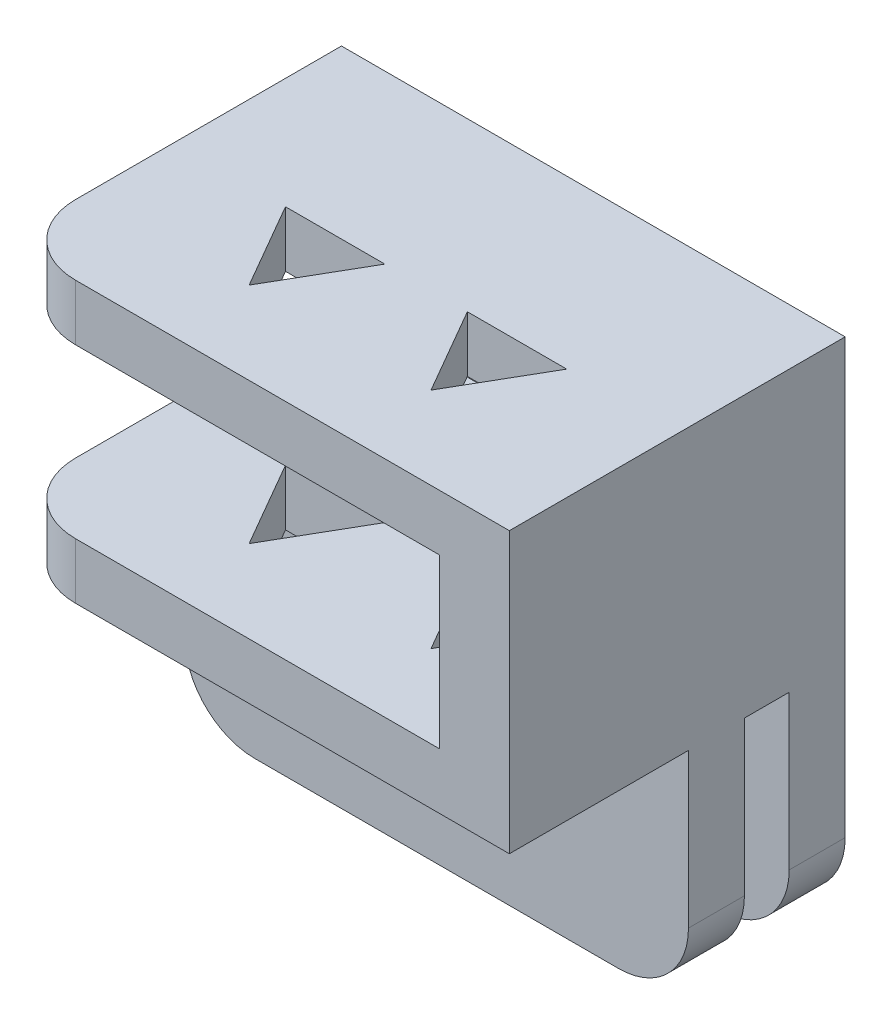
ISO-10303-21;
HEADER;
FILE_DESCRIPTION(('STEP AP214'),'2;1');
FILE_NAME('part.step','',(''),(''),'','','');
FILE_SCHEMA(('AUTOMOTIVE_DESIGN { 1 0 10303 214 1 1 1 1 }'));
ENDSEC;
DATA;
#1=APPLICATION_CONTEXT('core data for automotive mechanical design processes');
#2=APPLICATION_PROTOCOL_DEFINITION('international standard','automotive_design',2000,#1);
#3=PRODUCT_CONTEXT('',#1,'mechanical');
#4=PRODUCT('Part','Part','',(#3));
#5=PRODUCT_RELATED_PRODUCT_CATEGORY('part','',(#4));
#6=PRODUCT_DEFINITION_FORMATION('','',#4);
#7=PRODUCT_DEFINITION_CONTEXT('part definition',#1,'design');
#8=PRODUCT_DEFINITION('design','',#6,#7);
#9=PRODUCT_DEFINITION_SHAPE('','',#8);
#10=(LENGTH_UNIT() NAMED_UNIT(*) SI_UNIT(.MILLI.,.METRE.));
#11=(NAMED_UNIT(*) PLANE_ANGLE_UNIT() SI_UNIT($,.RADIAN.));
#12=(NAMED_UNIT(*) SI_UNIT($,.STERADIAN.) SOLID_ANGLE_UNIT());
#13=UNCERTAINTY_MEASURE_WITH_UNIT(LENGTH_MEASURE(1.E-05),#10,'distance_accuracy_value','');
#14=(GEOMETRIC_REPRESENTATION_CONTEXT(3) GLOBAL_UNCERTAINTY_ASSIGNED_CONTEXT((#13)) GLOBAL_UNIT_ASSIGNED_CONTEXT((#10,
#11,#12)) REPRESENTATION_CONTEXT('',''));
#15=CARTESIAN_POINT('',(0.,0.,0.));
#16=DIRECTION('',(0.,0.,1.));
#17=DIRECTION('',(1.,0.,0.));
#18=AXIS2_PLACEMENT_3D('',#15,#16,#17);
#19=CARTESIAN_POINT('',(-9.,0.,0.));
#20=DIRECTION('',(-1.,0.,0.));
#21=DIRECTION('',(0.,0.,1.));
#22=AXIS2_PLACEMENT_3D('',#19,#20,#21);
#23=PLANE('',#22);
#24=DIRECTION('',(0.,1.,0.));
#25=VECTOR('',#24,1.);
#26=CARTESIAN_POINT('',(-9.,-5.,-6.));
#27=LINE('',#26,#25);
#28=CARTESIAN_POINT('',(-9.,-10.5,-6.));
#29=VERTEX_POINT('',#28);
#30=CARTESIAN_POINT('',(-9.,-3.,-6.));
#31=VERTEX_POINT('',#30);
#32=EDGE_CURVE('E358',#29,#31,#27,.T.);
#33=ORIENTED_EDGE('',*,*,#32,.F.);
#34=DIRECTION('',(0.,0.,-1.));
#35=VECTOR('',#34,1.);
#36=CARTESIAN_POINT('',(-9.,-10.5,-4.));
#37=LINE('',#36,#35);
#38=CARTESIAN_POINT('',(-9.,-10.5,-4.));
#39=VERTEX_POINT('',#38);
#40=EDGE_CURVE('E470',#29,#39,#37,.F.);
#41=ORIENTED_EDGE('',*,*,#40,.T.);
#42=DIRECTION('',(0.,-1.,0.));
#43=VECTOR('',#42,1.);
#44=CARTESIAN_POINT('',(-9.,-13.,-4.));
#45=LINE('',#44,#43);
#46=CARTESIAN_POINT('',(-9.,-5.,-4.));
#47=VERTEX_POINT('',#46);
#48=EDGE_CURVE('E385',#47,#39,#45,.T.);
#49=ORIENTED_EDGE('',*,*,#48,.F.);
#50=DIRECTION('',(0.,0.,-1.));
#51=VECTOR('',#50,1.);
#52=CARTESIAN_POINT('',(-9.,-5.,-2.4));
#53=LINE('',#52,#51);
#54=CARTESIAN_POINT('',(-9.,-5.,-2.4));
#55=VERTEX_POINT('',#54);
#56=EDGE_CURVE('E383',#55,#47,#53,.T.);
#57=ORIENTED_EDGE('',*,*,#56,.F.);
#58=DIRECTION('',(0.,1.,0.));
#59=VECTOR('',#58,1.);
#60=CARTESIAN_POINT('',(-9.,-5.,-2.4));
#61=LINE('',#60,#59);
#62=CARTESIAN_POINT('',(-9.,-10.5,-2.4));
#63=VERTEX_POINT('',#62);
#64=EDGE_CURVE('E381',#63,#55,#61,.T.);
#65=ORIENTED_EDGE('',*,*,#64,.F.);
#66=DIRECTION('',(0.,0.,-1.));
#67=VECTOR('',#66,1.);
#68=CARTESIAN_POINT('',(-9.,-10.5,-0.400000000000004));
#69=LINE('',#68,#67);
#70=CARTESIAN_POINT('',(-9.,-10.5,-0.400000000000004));
#71=VERTEX_POINT('',#70);
#72=EDGE_CURVE('E468',#63,#71,#69,.F.);
#73=ORIENTED_EDGE('',*,*,#72,.T.);
#74=DIRECTION('',(0.,-1.,0.));
#75=VECTOR('',#74,1.);
#76=CARTESIAN_POINT('',(-9.,-13.,-0.400000000000004));
#77=LINE('',#76,#75);
#78=CARTESIAN_POINT('',(-9.,-5.,-0.400000000000004));
#79=VERTEX_POINT('',#78);
#80=EDGE_CURVE('E378',#79,#71,#77,.T.);
#81=ORIENTED_EDGE('',*,*,#80,.F.);
#82=DIRECTION('',(0.,0.,-1.));
#83=VECTOR('',#82,1.);
#84=CARTESIAN_POINT('',(-9.,-5.,6.));
#85=LINE('',#84,#83);
#86=CARTESIAN_POINT('',(-9.,-5.,3.5));
#87=VERTEX_POINT('',#86);
#88=EDGE_CURVE('E376',#87,#79,#85,.T.);
#89=ORIENTED_EDGE('',*,*,#88,.F.);
#90=DIRECTION('',(0.,-1.,0.));
#91=VECTOR('',#90,1.);
#92=CARTESIAN_POINT('',(-9.,-3.,3.5));
#93=LINE('',#92,#91);
#94=CARTESIAN_POINT('',(-9.,-3.,3.5));
#95=VERTEX_POINT('',#94);
#96=EDGE_CURVE('E466',#87,#95,#93,.F.);
#97=ORIENTED_EDGE('',*,*,#96,.T.);
#98=DIRECTION('',(0.,0.,1.));
#99=VECTOR('',#98,1.);
#100=CARTESIAN_POINT('',(-9.,-3.,-6.));
#101=LINE('',#100,#99);
#102=EDGE_CURVE('E349',#31,#95,#101,.T.);
#103=ORIENTED_EDGE('',*,*,#102,.F.);
#104=EDGE_LOOP('',(#33,#41,#49,#57,#65,#73,#81,#89,#97,#103));
#105=FACE_BOUND('',#104,.T.);
#106=ADVANCED_FACE('F33',(#105),#23,.T.);
#107=CARTESIAN_POINT('',(9.,5.,6.));
#108=DIRECTION('',(0.,-1.,0.));
#109=DIRECTION('',(0.,0.,-1.));
#110=AXIS2_PLACEMENT_3D('',#107,#108,#109);
#111=PLANE('',#110);
#112=DIRECTION('',(-1.,0.,0.));
#113=VECTOR('',#112,1.);
#114=CARTESIAN_POINT('',(-1.4746479222419,5.,-0.0250000000000033));
#115=LINE('',#114,#113);
#116=CARTESIAN_POINT('',(-1.4746479222419,5.,-0.0250000000000029));
#117=VERTEX_POINT('',#116);
#118=CARTESIAN_POINT('',(-5.0253520777581,5.,-0.0250000000000029));
#119=VERTEX_POINT('',#118);
#120=EDGE_CURVE('E258',#117,#119,#115,.T.);
#121=ORIENTED_EDGE('',*,*,#120,.F.);
#122=DIRECTION('',(0.5,0.,-0.866025403784439));
#123=VECTOR('',#122,1.);
#124=CARTESIAN_POINT('',(-3.25,5.,3.05));
#125=LINE('',#124,#123);
#126=CARTESIAN_POINT('',(-3.25,5.,3.05));
#127=VERTEX_POINT('',#126);
#128=EDGE_CURVE('E263',#127,#117,#125,.T.);
#129=ORIENTED_EDGE('',*,*,#128,.F.);
#130=DIRECTION('',(0.5,0.,0.866025403784439));
#131=VECTOR('',#130,1.);
#132=CARTESIAN_POINT('',(-5.0253520777581,5.,-0.0250000000000029));
#133=LINE('',#132,#131);
#134=EDGE_CURVE('E247',#119,#127,#133,.T.);
#135=ORIENTED_EDGE('',*,*,#134,.F.);
#136=EDGE_LOOP('',(#121,#129,#135));
#137=FACE_BOUND('',#136,.T.);
#138=DIRECTION('',(0.5,0.,-0.866025403784439));
#139=VECTOR('',#138,1.);
#140=CARTESIAN_POINT('',(3.25,5.,3.05));
#141=LINE('',#140,#139);
#142=CARTESIAN_POINT('',(3.25,5.,3.05));
#143=VERTEX_POINT('',#142);
#144=CARTESIAN_POINT('',(5.0253520777581,5.,-0.0250000000000007));
#145=VERTEX_POINT('',#144);
#146=EDGE_CURVE('E294',#143,#145,#141,.T.);
#147=ORIENTED_EDGE('',*,*,#146,.F.);
#148=DIRECTION('',(0.500000000000001,0.,0.866025403784438));
#149=VECTOR('',#148,1.);
#150=CARTESIAN_POINT('',(1.4746479222419,5.,-0.0249999999999998));
#151=LINE('',#150,#149);
#152=CARTESIAN_POINT('',(1.4746479222419,5.,-0.0249999999999998));
#153=VERTEX_POINT('',#152);
#154=EDGE_CURVE('E292',#153,#143,#151,.T.);
#155=ORIENTED_EDGE('',*,*,#154,.F.);
#156=DIRECTION('',(-1.,0.,0.));
#157=VECTOR('',#156,1.);
#158=CARTESIAN_POINT('',(5.0253520777581,5.,-0.0250000000000007));
#159=LINE('',#158,#157);
#160=EDGE_CURVE('E297',#145,#153,#159,.T.);
#161=ORIENTED_EDGE('',*,*,#160,.F.);
#162=EDGE_LOOP('',(#147,#155,#161));
#163=FACE_BOUND('',#162,.T.);
#164=DIRECTION('',(0.,0.,1.));
#165=VECTOR('',#164,1.);
#166=CARTESIAN_POINT('',(-9.,5.,6.));
#167=LINE('',#166,#165);
#168=CARTESIAN_POINT('',(-9.,5.,-6.));
#169=VERTEX_POINT('',#168);
#170=CARTESIAN_POINT('',(-9.,5.,3.5));
#171=VERTEX_POINT('',#170);
#172=EDGE_CURVE('E348',#169,#171,#167,.T.);
#173=ORIENTED_EDGE('',*,*,#172,.T.);
#174=CARTESIAN_POINT('',(-6.5,5.,3.5));
#175=DIRECTION('',(0.,-1.,0.));
#176=DIRECTION('',(0.,0.,-1.));
#177=AXIS2_PLACEMENT_3D('',#174,#175,#176);
#178=CIRCLE('',#177,2.5);
#179=CARTESIAN_POINT('',(-6.5,5.,6.));
#180=VERTEX_POINT('',#179);
#181=EDGE_CURVE('E480',#171,#180,#178,.F.);
#182=ORIENTED_EDGE('',*,*,#181,.T.);
#183=DIRECTION('',(-1.,0.,0.));
#184=VECTOR('',#183,1.);
#185=CARTESIAN_POINT('',(9.,5.,6.));
#186=LINE('',#185,#184);
#187=CARTESIAN_POINT('',(9.,5.,6.));
#188=VERTEX_POINT('',#187);
#189=EDGE_CURVE('E413',#188,#180,#186,.T.);
#190=ORIENTED_EDGE('',*,*,#189,.F.);
#191=DIRECTION('',(0.,0.,1.));
#192=VECTOR('',#191,1.);
#193=CARTESIAN_POINT('',(9.,5.,6.));
#194=LINE('',#193,#192);
#195=CARTESIAN_POINT('',(9.,5.,-6.));
#196=VERTEX_POINT('',#195);
#197=EDGE_CURVE('E357',#196,#188,#194,.T.);
#198=ORIENTED_EDGE('',*,*,#197,.F.);
#199=DIRECTION('',(-1.,0.,0.));
#200=VECTOR('',#199,1.);
#201=CARTESIAN_POINT('',(9.,5.,-6.));
#202=LINE('',#201,#200);
#203=EDGE_CURVE('E416',#196,#169,#202,.T.);
#204=ORIENTED_EDGE('',*,*,#203,.T.);
#205=EDGE_LOOP('',(#173,#182,#190,#198,#204));
#206=FACE_BOUND('',#205,.T.);
#207=ADVANCED_FACE('F265',(#137,#163,#206),#111,.F.);
#208=CARTESIAN_POINT('',(9.,5.,6.));
#209=DIRECTION('',(0.,0.,-1.));
#210=DIRECTION('',(0.,1.,0.));
#211=AXIS2_PLACEMENT_3D('',#208,#209,#210);
#212=PLANE('',#211);
#213=ORIENTED_EDGE('',*,*,#189,.T.);
#214=DIRECTION('',(0.,-1.,0.));
#215=VECTOR('',#214,1.);
#216=CARTESIAN_POINT('',(-6.5,3.,6.));
#217=LINE('',#216,#215);
#218=CARTESIAN_POINT('',(-6.5,3.,6.));
#219=VERTEX_POINT('',#218);
#220=EDGE_CURVE('E475',#180,#219,#217,.T.);
#221=ORIENTED_EDGE('',*,*,#220,.T.);
#222=DIRECTION('',(-1.,0.,0.));
#223=VECTOR('',#222,1.);
#224=CARTESIAN_POINT('',(-6.5,3.,6.));
#225=LINE('',#224,#223);
#226=CARTESIAN_POINT('',(6.5,3.,6.));
#227=VERTEX_POINT('',#226);
#228=EDGE_CURVE('E342',#227,#219,#225,.T.);
#229=ORIENTED_EDGE('',*,*,#228,.F.);
#230=DIRECTION('',(0.,1.,0.));
#231=VECTOR('',#230,1.);
#232=CARTESIAN_POINT('',(6.5,3.,6.));
#233=LINE('',#232,#231);
#234=CARTESIAN_POINT('',(6.5,-3.,6.));
#235=VERTEX_POINT('',#234);
#236=EDGE_CURVE('E328',#235,#227,#233,.T.);
#237=ORIENTED_EDGE('',*,*,#236,.F.);
#238=DIRECTION('',(1.,0.,0.));
#239=VECTOR('',#238,1.);
#240=CARTESIAN_POINT('',(-6.5,-3.,6.));
#241=LINE('',#240,#239);
#242=CARTESIAN_POINT('',(-6.5,-3.,6.));
#243=VERTEX_POINT('',#242);
#244=EDGE_CURVE('E333',#243,#235,#241,.T.);
#245=ORIENTED_EDGE('',*,*,#244,.F.);
#246=DIRECTION('',(0.,-1.,0.));
#247=VECTOR('',#246,1.);
#248=CARTESIAN_POINT('',(-6.5,-5.,6.));
#249=LINE('',#248,#247);
#250=CARTESIAN_POINT('',(-6.5,-5.,6.));
#251=VERTEX_POINT('',#250);
#252=EDGE_CURVE('E472',#243,#251,#249,.T.);
#253=ORIENTED_EDGE('',*,*,#252,.T.);
#254=DIRECTION('',(-1.,0.,0.));
#255=VECTOR('',#254,1.);
#256=CARTESIAN_POINT('',(9.,-5.,6.));
#257=LINE('',#256,#255);
#258=CARTESIAN_POINT('',(9.,-5.,6.));
#259=VERTEX_POINT('',#258);
#260=EDGE_CURVE('E410',#259,#251,#257,.T.);
#261=ORIENTED_EDGE('',*,*,#260,.F.);
#262=DIRECTION('',(0.,-1.,0.));
#263=VECTOR('',#262,1.);
#264=CARTESIAN_POINT('',(9.,5.,6.));
#265=LINE('',#264,#263);
#266=EDGE_CURVE('E360',#188,#259,#265,.T.);
#267=ORIENTED_EDGE('',*,*,#266,.F.);
#268=EDGE_LOOP('',(#213,#221,#229,#237,#245,#253,#261,#267));
#269=FACE_BOUND('',#268,.T.);
#270=ADVANCED_FACE('F501',(#269),#212,.F.);
#271=CARTESIAN_POINT('',(9.,-5.,6.));
#272=DIRECTION('',(0.,1.,0.));
#273=DIRECTION('',(0.,0.,1.));
#274=AXIS2_PLACEMENT_3D('',#271,#272,#273);
#275=PLANE('',#274);
#276=DIRECTION('',(0.5,0.,0.866025403784439));
#277=VECTOR('',#276,1.);
#278=CARTESIAN_POINT('',(1.08988747058204,-5.,10.5669055981797));
#279=LINE('',#278,#277);
#280=CARTESIAN_POINT('',(-5.0253520777581,-5.,-0.0250000000000025));
#281=VERTEX_POINT('',#280);
#282=CARTESIAN_POINT('',(-3.25,-5.,3.05));
#283=VERTEX_POINT('',#282);
#284=EDGE_CURVE('E283',#281,#283,#279,.T.);
#285=ORIENTED_EDGE('',*,*,#284,.T.);
#286=DIRECTION('',(0.5,0.,-0.866025403784439));
#287=VECTOR('',#286,1.);
#288=CARTESIAN_POINT('',(-1.46488747058205,-5.,-0.0419055981796847));
#289=LINE('',#288,#287);
#290=CARTESIAN_POINT('',(-1.4746479222419,-5.,-0.0250000000000033));
#291=VERTEX_POINT('',#290);
#292=EDGE_CURVE('E289',#283,#291,#289,.T.);
#293=ORIENTED_EDGE('',*,*,#292,.T.);
#294=DIRECTION('',(-1.,0.,0.));
#295=VECTOR('',#294,1.);
#296=CARTESIAN_POINT('',(9.,-5.,-0.0250000000000042));
#297=LINE('',#296,#295);
#298=EDGE_CURVE('E277',#291,#281,#297,.T.);
#299=ORIENTED_EDGE('',*,*,#298,.T.);
#300=EDGE_LOOP('',(#285,#293,#299));
#301=FACE_BOUND('',#300,.T.);
#302=DIRECTION('',(-1.,0.,0.));
#303=VECTOR('',#302,1.);
#304=CARTESIAN_POINT('',(9.,-5.,-0.0250000000000016));
#305=LINE('',#304,#303);
#306=CARTESIAN_POINT('',(5.0253520777581,-5.,-0.0250000000000007));
#307=VERTEX_POINT('',#306);
#308=CARTESIAN_POINT('',(1.4746479222419,-5.,-0.0249999999999998));
#309=VERTEX_POINT('',#308);
#310=EDGE_CURVE('E319',#307,#309,#305,.T.);
#311=ORIENTED_EDGE('',*,*,#310,.T.);
#312=DIRECTION('',(0.500000000000001,0.,0.866025403784438));
#313=VECTOR('',#312,1.);
#314=CARTESIAN_POINT('',(5.96488747058205,-5.,7.75232303588026));
#315=LINE('',#314,#313);
#316=CARTESIAN_POINT('',(3.25,-5.,3.05));
#317=VERTEX_POINT('',#316);
#318=EDGE_CURVE('E325',#309,#317,#315,.T.);
#319=ORIENTED_EDGE('',*,*,#318,.T.);
#320=DIRECTION('',(0.5,0.,-0.866025403784439));
#321=VECTOR('',#320,1.);
#322=CARTESIAN_POINT('',(3.41011252941795,-5.,2.77267696411974));
#323=LINE('',#322,#321);
#324=EDGE_CURVE('E313',#317,#307,#323,.T.);
#325=ORIENTED_EDGE('',*,*,#324,.T.);
#326=EDGE_LOOP('',(#311,#319,#325));
#327=FACE_BOUND('',#326,.T.);
#328=ORIENTED_EDGE('',*,*,#260,.T.);
#329=CARTESIAN_POINT('',(-6.5,-5.,3.5));
#330=DIRECTION('',(0.,1.,0.));
#331=DIRECTION('',(0.,0.,1.));
#332=AXIS2_PLACEMENT_3D('',#329,#330,#331);
#333=CIRCLE('',#332,2.5);
#334=EDGE_CURVE('E41',#251,#87,#333,.F.);
#335=ORIENTED_EDGE('',*,*,#334,.T.);
#336=ORIENTED_EDGE('',*,*,#88,.T.);
#337=DIRECTION('',(-1.,0.,0.));
#338=VECTOR('',#337,1.);
#339=CARTESIAN_POINT('',(9.,-5.,-0.400000000000004));
#340=LINE('',#339,#338);
#341=CARTESIAN_POINT('',(9.,-5.,-0.400000000000004));
#342=VERTEX_POINT('',#341);
#343=EDGE_CURVE('E407',#342,#79,#340,.T.);
#344=ORIENTED_EDGE('',*,*,#343,.F.);
#345=DIRECTION('',(0.,0.,-1.));
#346=VECTOR('',#345,1.);
#347=CARTESIAN_POINT('',(9.,-5.,6.));
#348=LINE('',#347,#346);
#349=EDGE_CURVE('E362',#259,#342,#348,.T.);
#350=ORIENTED_EDGE('',*,*,#349,.F.);
#351=EDGE_LOOP('',(#328,#335,#336,#344,#350));
#352=FACE_BOUND('',#351,.T.);
#353=ADVANCED_FACE('F483',(#301,#327,#352),#275,.F.);
#354=CARTESIAN_POINT('',(9.,-13.,-0.400000000000004));
#355=DIRECTION('',(0.,0.,-1.));
#356=DIRECTION('',(0.,1.,0.));
#357=AXIS2_PLACEMENT_3D('',#354,#355,#356);
#358=PLANE('',#357);
#359=DIRECTION('',(-1.,0.,0.));
#360=VECTOR('',#359,1.);
#361=CARTESIAN_POINT('',(9.,-13.,-0.400000000000004));
#362=LINE('',#361,#360);
#363=CARTESIAN_POINT('',(6.5,-13.,-0.400000000000004));
#364=VERTEX_POINT('',#363);
#365=CARTESIAN_POINT('',(-6.5,-13.,-0.400000000000004));
#366=VERTEX_POINT('',#365);
#367=EDGE_CURVE('E404',#364,#366,#362,.T.);
#368=ORIENTED_EDGE('',*,*,#367,.F.);
#369=CARTESIAN_POINT('',(6.5,-10.5,-0.400000000000004));
#370=DIRECTION('',(0.,0.,-1.));
#371=DIRECTION('',(0.,1.,0.));
#372=AXIS2_PLACEMENT_3D('',#369,#370,#371);
#373=CIRCLE('',#372,2.5);
#374=CARTESIAN_POINT('',(9.,-10.5,-0.400000000000004));
#375=VERTEX_POINT('',#374);
#376=EDGE_CURVE('E451',#364,#375,#373,.F.);
#377=ORIENTED_EDGE('',*,*,#376,.T.);
#378=DIRECTION('',(0.,-1.,0.));
#379=VECTOR('',#378,1.);
#380=CARTESIAN_POINT('',(9.,-13.,-0.400000000000004));
#381=LINE('',#380,#379);
#382=EDGE_CURVE('E364',#342,#375,#381,.T.);
#383=ORIENTED_EDGE('',*,*,#382,.F.);
#384=ORIENTED_EDGE('',*,*,#343,.T.);
#385=ORIENTED_EDGE('',*,*,#80,.T.);
#386=CARTESIAN_POINT('',(-6.5,-10.5,-0.400000000000004));
#387=DIRECTION('',(0.,0.,-1.));
#388=DIRECTION('',(0.,1.,0.));
#389=AXIS2_PLACEMENT_3D('',#386,#387,#388);
#390=CIRCLE('',#389,2.5);
#391=EDGE_CURVE('E449',#71,#366,#390,.F.);
#392=ORIENTED_EDGE('',*,*,#391,.T.);
#393=EDGE_LOOP('',(#368,#377,#383,#384,#385,#392));
#394=FACE_BOUND('',#393,.T.);
#395=ADVANCED_FACE('F545',(#394),#358,.F.);
#396=CARTESIAN_POINT('',(9.,-13.,-2.4));
#397=DIRECTION('',(0.,1.,0.));
#398=DIRECTION('',(0.,0.,1.));
#399=AXIS2_PLACEMENT_3D('',#396,#397,#398);
#400=PLANE('',#399);
#401=DIRECTION('',(-1.,0.,0.));
#402=VECTOR('',#401,1.);
#403=CARTESIAN_POINT('',(9.,-13.,-2.4));
#404=LINE('',#403,#402);
#405=CARTESIAN_POINT('',(6.5,-13.,-2.4));
#406=VERTEX_POINT('',#405);
#407=CARTESIAN_POINT('',(-6.5,-13.,-2.4));
#408=VERTEX_POINT('',#407);
#409=EDGE_CURVE('E401',#406,#408,#404,.T.);
#410=ORIENTED_EDGE('',*,*,#409,.F.);
#411=DIRECTION('',(0.,0.,-1.));
#412=VECTOR('',#411,1.);
#413=CARTESIAN_POINT('',(6.5,-13.,-2.4));
#414=LINE('',#413,#412);
#415=EDGE_CURVE('E447',#406,#364,#414,.F.);
#416=ORIENTED_EDGE('',*,*,#415,.T.);
#417=ORIENTED_EDGE('',*,*,#367,.T.);
#418=DIRECTION('',(0.,0.,-1.));
#419=VECTOR('',#418,1.);
#420=CARTESIAN_POINT('',(-6.5,-13.,-2.4));
#421=LINE('',#420,#419);
#422=EDGE_CURVE('E444',#366,#408,#421,.T.);
#423=ORIENTED_EDGE('',*,*,#422,.T.);
#424=EDGE_LOOP('',(#410,#416,#417,#423));
#425=FACE_BOUND('',#424,.T.);
#426=ADVANCED_FACE('F549',(#425),#400,.F.);
#427=CARTESIAN_POINT('',(9.,-5.,-2.4));
#428=DIRECTION('',(0.,0.,1.));
#429=DIRECTION('',(0.,-1.,0.));
#430=AXIS2_PLACEMENT_3D('',#427,#428,#429);
#431=PLANE('',#430);
#432=DIRECTION('',(0.,1.,0.));
#433=VECTOR('',#432,1.);
#434=CARTESIAN_POINT('',(9.,-5.,-2.4));
#435=LINE('',#434,#433);
#436=CARTESIAN_POINT('',(9.,-10.5,-2.4));
#437=VERTEX_POINT('',#436);
#438=CARTESIAN_POINT('',(9.,-5.,-2.4));
#439=VERTEX_POINT('',#438);
#440=EDGE_CURVE('E367',#437,#439,#435,.T.);
#441=ORIENTED_EDGE('',*,*,#440,.F.);
#442=CARTESIAN_POINT('',(6.5,-10.5,-2.4));
#443=DIRECTION('',(0.,0.,1.));
#444=DIRECTION('',(0.,-1.,0.));
#445=AXIS2_PLACEMENT_3D('',#442,#443,#444);
#446=CIRCLE('',#445,2.5);
#447=EDGE_CURVE('E442',#437,#406,#446,.F.);
#448=ORIENTED_EDGE('',*,*,#447,.T.);
#449=ORIENTED_EDGE('',*,*,#409,.T.);
#450=CARTESIAN_POINT('',(-6.5,-10.5,-2.4));
#451=DIRECTION('',(0.,0.,1.));
#452=DIRECTION('',(0.,-1.,0.));
#453=AXIS2_PLACEMENT_3D('',#450,#451,#452);
#454=CIRCLE('',#453,2.5);
#455=EDGE_CURVE('E440',#408,#63,#454,.F.);
#456=ORIENTED_EDGE('',*,*,#455,.T.);
#457=ORIENTED_EDGE('',*,*,#64,.T.);
#458=DIRECTION('',(-1.,0.,0.));
#459=VECTOR('',#458,1.);
#460=CARTESIAN_POINT('',(9.,-5.,-2.4));
#461=LINE('',#460,#459);
#462=EDGE_CURVE('E398',#439,#55,#461,.T.);
#463=ORIENTED_EDGE('',*,*,#462,.F.);
#464=EDGE_LOOP('',(#441,#448,#449,#456,#457,#463));
#465=FACE_BOUND('',#464,.T.);
#466=ADVANCED_FACE('F611',(#465),#431,.F.);
#467=CARTESIAN_POINT('',(9.,-5.,-2.4));
#468=DIRECTION('',(0.,1.,0.));
#469=DIRECTION('',(0.,0.,1.));
#470=AXIS2_PLACEMENT_3D('',#467,#468,#469);
#471=PLANE('',#470);
#472=ORIENTED_EDGE('',*,*,#56,.T.);
#473=DIRECTION('',(-1.,0.,0.));
#474=VECTOR('',#473,1.);
#475=CARTESIAN_POINT('',(9.,-5.,-4.));
#476=LINE('',#475,#474);
#477=CARTESIAN_POINT('',(9.,-5.,-4.));
#478=VERTEX_POINT('',#477);
#479=EDGE_CURVE('E395',#478,#47,#476,.T.);
#480=ORIENTED_EDGE('',*,*,#479,.F.);
#481=DIRECTION('',(0.,0.,-1.));
#482=VECTOR('',#481,1.);
#483=CARTESIAN_POINT('',(9.,-5.,-2.4));
#484=LINE('',#483,#482);
#485=EDGE_CURVE('E369',#439,#478,#484,.T.);
#486=ORIENTED_EDGE('',*,*,#485,.F.);
#487=ORIENTED_EDGE('',*,*,#462,.T.);
#488=EDGE_LOOP('',(#472,#480,#486,#487));
#489=FACE_BOUND('',#488,.T.);
#490=ADVANCED_FACE('F534',(#489),#471,.F.);
#491=CARTESIAN_POINT('',(9.,-13.,-4.));
#492=DIRECTION('',(0.,0.,-1.));
#493=DIRECTION('',(0.,1.,0.));
#494=AXIS2_PLACEMENT_3D('',#491,#492,#493);
#495=PLANE('',#494);
#496=DIRECTION('',(-1.,0.,0.));
#497=VECTOR('',#496,1.);
#498=CARTESIAN_POINT('',(9.,-13.,-4.));
#499=LINE('',#498,#497);
#500=CARTESIAN_POINT('',(6.5,-13.,-4.));
#501=VERTEX_POINT('',#500);
#502=CARTESIAN_POINT('',(-6.5,-13.,-4.));
#503=VERTEX_POINT('',#502);
#504=EDGE_CURVE('E392',#501,#503,#499,.T.);
#505=ORIENTED_EDGE('',*,*,#504,.F.);
#506=CARTESIAN_POINT('',(6.5,-10.5,-4.));
#507=DIRECTION('',(0.,0.,-1.));
#508=DIRECTION('',(0.,1.,0.));
#509=AXIS2_PLACEMENT_3D('',#506,#507,#508);
#510=CIRCLE('',#509,2.5);
#511=CARTESIAN_POINT('',(9.,-10.5,-4.));
#512=VERTEX_POINT('',#511);
#513=EDGE_CURVE('E464',#501,#512,#510,.F.);
#514=ORIENTED_EDGE('',*,*,#513,.T.);
#515=DIRECTION('',(0.,-1.,0.));
#516=VECTOR('',#515,1.);
#517=CARTESIAN_POINT('',(9.,-13.,-4.));
#518=LINE('',#517,#516);
#519=EDGE_CURVE('E371',#478,#512,#518,.T.);
#520=ORIENTED_EDGE('',*,*,#519,.F.);
#521=ORIENTED_EDGE('',*,*,#479,.T.);
#522=ORIENTED_EDGE('',*,*,#48,.T.);
#523=CARTESIAN_POINT('',(-6.5,-10.5,-4.));
#524=DIRECTION('',(0.,0.,-1.));
#525=DIRECTION('',(0.,1.,0.));
#526=AXIS2_PLACEMENT_3D('',#523,#524,#525);
#527=CIRCLE('',#526,2.5);
#528=EDGE_CURVE('E462',#39,#503,#527,.F.);
#529=ORIENTED_EDGE('',*,*,#528,.T.);
#530=EDGE_LOOP('',(#505,#514,#520,#521,#522,#529));
#531=FACE_BOUND('',#530,.T.);
#532=ADVANCED_FACE('F516',(#531),#495,.F.);
#533=CARTESIAN_POINT('',(9.,-13.,-6.));
#534=DIRECTION('',(0.,1.,0.));
#535=DIRECTION('',(0.,0.,1.));
#536=AXIS2_PLACEMENT_3D('',#533,#534,#535);
#537=PLANE('',#536);
#538=DIRECTION('',(-1.,0.,0.));
#539=VECTOR('',#538,1.);
#540=CARTESIAN_POINT('',(9.,-13.,-6.));
#541=LINE('',#540,#539);
#542=CARTESIAN_POINT('',(6.5,-13.,-6.));
#543=VERTEX_POINT('',#542);
#544=CARTESIAN_POINT('',(-6.5,-13.,-6.));
#545=VERTEX_POINT('',#544);
#546=EDGE_CURVE('E374',#543,#545,#541,.T.);
#547=ORIENTED_EDGE('',*,*,#546,.F.);
#548=DIRECTION('',(0.,0.,-1.));
#549=VECTOR('',#548,1.);
#550=CARTESIAN_POINT('',(6.5,-13.,-6.));
#551=LINE('',#550,#549);
#552=EDGE_CURVE('E460',#543,#501,#551,.F.);
#553=ORIENTED_EDGE('',*,*,#552,.T.);
#554=ORIENTED_EDGE('',*,*,#504,.T.);
#555=DIRECTION('',(0.,0.,-1.));
#556=VECTOR('',#555,1.);
#557=CARTESIAN_POINT('',(-6.5,-13.,-6.));
#558=LINE('',#557,#556);
#559=EDGE_CURVE('E457',#503,#545,#558,.T.);
#560=ORIENTED_EDGE('',*,*,#559,.T.);
#561=EDGE_LOOP('',(#547,#553,#554,#560));
#562=FACE_BOUND('',#561,.T.);
#563=ADVANCED_FACE('F520',(#562),#537,.F.);
#564=CARTESIAN_POINT('',(9.,-5.,-6.));
#565=DIRECTION('',(0.,0.,1.));
#566=DIRECTION('',(0.,-1.,0.));
#567=AXIS2_PLACEMENT_3D('',#564,#565,#566);
#568=PLANE('',#567);
#569=DIRECTION('',(0.,1.,0.));
#570=VECTOR('',#569,1.);
#571=CARTESIAN_POINT('',(9.,5.,-6.));
#572=LINE('',#571,#570);
#573=CARTESIAN_POINT('',(9.,-10.5,-6.));
#574=VERTEX_POINT('',#573);
#575=EDGE_CURVE('E355',#574,#196,#572,.T.);
#576=ORIENTED_EDGE('',*,*,#575,.F.);
#577=CARTESIAN_POINT('',(6.5,-10.5,-6.));
#578=DIRECTION('',(0.,0.,1.));
#579=DIRECTION('',(0.,-1.,0.));
#580=AXIS2_PLACEMENT_3D('',#577,#578,#579);
#581=CIRCLE('',#580,2.5);
#582=EDGE_CURVE('E455',#574,#543,#581,.F.);
#583=ORIENTED_EDGE('',*,*,#582,.T.);
#584=ORIENTED_EDGE('',*,*,#546,.T.);
#585=CARTESIAN_POINT('',(-6.5,-10.5,-6.));
#586=DIRECTION('',(0.,0.,1.));
#587=DIRECTION('',(0.,-1.,0.));
#588=AXIS2_PLACEMENT_3D('',#585,#586,#587);
#589=CIRCLE('',#588,2.5);
#590=EDGE_CURVE('E453',#545,#29,#589,.F.);
#591=ORIENTED_EDGE('',*,*,#590,.T.);
#592=ORIENTED_EDGE('',*,*,#32,.T.);
#593=DIRECTION('',(1.,0.,0.));
#594=VECTOR('',#593,1.);
#595=CARTESIAN_POINT('',(-6.5,-3.,-6.));
#596=LINE('',#595,#594);
#597=CARTESIAN_POINT('',(6.5,-3.,-6.));
#598=VERTEX_POINT('',#597);
#599=EDGE_CURVE('E336',#31,#598,#596,.T.);
#600=ORIENTED_EDGE('',*,*,#599,.T.);
#601=DIRECTION('',(0.,1.,0.));
#602=VECTOR('',#601,1.);
#603=CARTESIAN_POINT('',(6.5,3.,-6.));
#604=LINE('',#603,#602);
#605=CARTESIAN_POINT('',(6.5,3.,-6.));
#606=VERTEX_POINT('',#605);
#607=EDGE_CURVE('E329',#598,#606,#604,.T.);
#608=ORIENTED_EDGE('',*,*,#607,.T.);
#609=DIRECTION('',(-1.,0.,0.));
#610=VECTOR('',#609,1.);
#611=CARTESIAN_POINT('',(-6.5,3.,-6.));
#612=LINE('',#611,#610);
#613=CARTESIAN_POINT('',(-9.,3.,-6.));
#614=VERTEX_POINT('',#613);
#615=EDGE_CURVE('E332',#606,#614,#612,.T.);
#616=ORIENTED_EDGE('',*,*,#615,.T.);
#617=EDGE_CURVE('E388',#614,#169,#27,.T.);
#618=ORIENTED_EDGE('',*,*,#617,.T.);
#619=ORIENTED_EDGE('',*,*,#203,.F.);
#620=EDGE_LOOP('',(#576,#583,#584,#591,#592,#600,#608,#616,#618,#619));
#621=FACE_BOUND('',#620,.T.);
#622=ADVANCED_FACE('F566',(#621),#568,.F.);
#623=CARTESIAN_POINT('',(9.,0.,0.));
#624=DIRECTION('',(-1.,0.,0.));
#625=DIRECTION('',(0.,0.,1.));
#626=AXIS2_PLACEMENT_3D('',#623,#624,#625);
#627=PLANE('',#626);
#628=ORIENTED_EDGE('',*,*,#382,.T.);
#629=DIRECTION('',(0.,0.,-1.));
#630=VECTOR('',#629,1.);
#631=CARTESIAN_POINT('',(9.,-10.5,0.));
#632=LINE('',#631,#630);
#633=EDGE_CURVE('E437',#375,#437,#632,.T.);
#634=ORIENTED_EDGE('',*,*,#633,.T.);
#635=ORIENTED_EDGE('',*,*,#440,.T.);
#636=ORIENTED_EDGE('',*,*,#485,.T.);
#637=ORIENTED_EDGE('',*,*,#519,.T.);
#638=DIRECTION('',(0.,0.,-1.));
#639=VECTOR('',#638,1.);
#640=CARTESIAN_POINT('',(9.,-10.5,0.));
#641=LINE('',#640,#639);
#642=EDGE_CURVE('E434',#512,#574,#641,.T.);
#643=ORIENTED_EDGE('',*,*,#642,.T.);
#644=ORIENTED_EDGE('',*,*,#575,.T.);
#645=ORIENTED_EDGE('',*,*,#197,.T.);
#646=ORIENTED_EDGE('',*,*,#266,.T.);
#647=ORIENTED_EDGE('',*,*,#349,.T.);
#648=EDGE_LOOP('',(#628,#634,#635,#636,#637,#643,#644,#645,#646,#647));
#649=FACE_BOUND('',#648,.T.);
#650=ADVANCED_FACE('F527',(#649),#627,.F.);
#651=DIRECTION('',(0.,0.,1.));
#652=VECTOR('',#651,1.);
#653=CARTESIAN_POINT('',(-9.,3.,-6.));
#654=LINE('',#653,#652);
#655=CARTESIAN_POINT('',(-9.,3.,3.5));
#656=VERTEX_POINT('',#655);
#657=EDGE_CURVE('E352',#614,#656,#654,.T.);
#658=ORIENTED_EDGE('',*,*,#657,.T.);
#659=DIRECTION('',(0.,-1.,0.));
#660=VECTOR('',#659,1.);
#661=CARTESIAN_POINT('',(-9.,5.,3.5));
#662=LINE('',#661,#660);
#663=EDGE_CURVE('E48',#656,#171,#662,.F.);
#664=ORIENTED_EDGE('',*,*,#663,.T.);
#665=ORIENTED_EDGE('',*,*,#172,.F.);
#666=ORIENTED_EDGE('',*,*,#617,.F.);
#667=EDGE_LOOP('',(#658,#664,#665,#666));
#668=FACE_BOUND('',#667,.T.);
#669=ADVANCED_FACE('F565',(#668),#23,.T.);
#670=CARTESIAN_POINT('',(6.5,3.,-6.));
#671=DIRECTION('',(1.,0.,0.));
#672=DIRECTION('',(0.,1.,0.));
#673=AXIS2_PLACEMENT_3D('',#670,#671,#672);
#674=PLANE('',#673);
#675=ORIENTED_EDGE('',*,*,#236,.T.);
#676=DIRECTION('',(0.,0.,1.));
#677=VECTOR('',#676,1.);
#678=CARTESIAN_POINT('',(6.5,3.,-6.));
#679=LINE('',#678,#677);
#680=EDGE_CURVE('E339',#606,#227,#679,.T.);
#681=ORIENTED_EDGE('',*,*,#680,.F.);
#682=ORIENTED_EDGE('',*,*,#607,.F.);
#683=DIRECTION('',(0.,0.,1.));
#684=VECTOR('',#683,1.);
#685=CARTESIAN_POINT('',(6.5,-3.,-6.));
#686=LINE('',#685,#684);
#687=EDGE_CURVE('E345',#598,#235,#686,.T.);
#688=ORIENTED_EDGE('',*,*,#687,.T.);
#689=EDGE_LOOP('',(#675,#681,#682,#688));
#690=FACE_BOUND('',#689,.T.);
#691=ADVANCED_FACE('F504',(#690),#674,.F.);
#692=CARTESIAN_POINT('',(-6.5,-3.,-6.));
#693=DIRECTION('',(0.,-1.,0.));
#694=DIRECTION('',(1.,0.,0.));
#695=AXIS2_PLACEMENT_3D('',#692,#693,#694);
#696=PLANE('',#695);
#697=DIRECTION('',(1.,0.,0.));
#698=VECTOR('',#697,1.);
#699=CARTESIAN_POINT('',(-6.5,-3.,-0.0250000000000025));
#700=LINE('',#699,#698);
#701=CARTESIAN_POINT('',(-5.0253520777581,-3.,-0.0250000000000029));
#702=VERTEX_POINT('',#701);
#703=CARTESIAN_POINT('',(-1.4746479222419,-3.,-0.0250000000000031));
#704=VERTEX_POINT('',#703);
#705=EDGE_CURVE('E274',#702,#704,#700,.T.);
#706=ORIENTED_EDGE('',*,*,#705,.T.);
#707=DIRECTION('',(-0.5,0.,0.866025403784439));
#708=VECTOR('',#707,1.);
#709=CARTESIAN_POINT('',(-0.143735047875414,-3.,-2.33020871885029));
#710=LINE('',#709,#708);
#711=CARTESIAN_POINT('',(-3.25,-3.,3.05));
#712=VERTEX_POINT('',#711);
#713=EDGE_CURVE('E286',#704,#712,#710,.T.);
#714=ORIENTED_EDGE('',*,*,#713,.T.);
#715=DIRECTION('',(-0.5,0.,-0.866025403784439));
#716=VECTOR('',#715,1.);
#717=CARTESIAN_POINT('',(-7.98126495212458,-3.,-5.14479128114972));
#718=LINE('',#717,#716);
#719=EDGE_CURVE('E280',#712,#702,#718,.T.);
#720=ORIENTED_EDGE('',*,*,#719,.T.);
#721=EDGE_LOOP('',(#706,#714,#720));
#722=FACE_BOUND('',#721,.T.);
#723=DIRECTION('',(-0.5,0.,0.866025403784439));
#724=VECTOR('',#723,1.);
#725=CARTESIAN_POINT('',(4.73126495212459,-3.,0.484373843449131));
#726=LINE('',#725,#724);
#727=CARTESIAN_POINT('',(5.0253520777581,-3.,-0.0250000000000007));
#728=VERTEX_POINT('',#727);
#729=CARTESIAN_POINT('',(3.25,-3.,3.05));
#730=VERTEX_POINT('',#729);
#731=EDGE_CURVE('E310',#728,#730,#726,.T.);
#732=ORIENTED_EDGE('',*,*,#731,.T.);
#733=DIRECTION('',(-0.500000000000001,0.,-0.866025403784438));
#734=VECTOR('',#733,1.);
#735=CARTESIAN_POINT('',(-3.1062649521246,-3.,-7.95937384344914));
#736=LINE('',#735,#734);
#737=CARTESIAN_POINT('',(1.4746479222419,-3.,-0.0249999999999998));
#738=VERTEX_POINT('',#737);
#739=EDGE_CURVE('E322',#730,#738,#736,.T.);
#740=ORIENTED_EDGE('',*,*,#739,.T.);
#741=DIRECTION('',(1.,0.,0.));
#742=VECTOR('',#741,1.);
#743=CARTESIAN_POINT('',(-6.5,-3.,-0.0249999999999981));
#744=LINE('',#743,#742);
#745=EDGE_CURVE('E316',#738,#728,#744,.T.);
#746=ORIENTED_EDGE('',*,*,#745,.T.);
#747=EDGE_LOOP('',(#732,#740,#746));
#748=FACE_BOUND('',#747,.T.);
#749=ORIENTED_EDGE('',*,*,#102,.T.);
#750=CARTESIAN_POINT('',(-6.5,-3.,3.5));
#751=DIRECTION('',(0.,-1.,0.));
#752=DIRECTION('',(1.,0.,0.));
#753=AXIS2_PLACEMENT_3D('',#750,#751,#752);
#754=CIRCLE('',#753,2.5);
#755=EDGE_CURVE('E11',#95,#243,#754,.F.);
#756=ORIENTED_EDGE('',*,*,#755,.T.);
#757=ORIENTED_EDGE('',*,*,#244,.T.);
#758=ORIENTED_EDGE('',*,*,#687,.F.);
#759=ORIENTED_EDGE('',*,*,#599,.F.);
#760=EDGE_LOOP('',(#749,#756,#757,#758,#759));
#761=FACE_BOUND('',#760,.T.);
#762=ADVANCED_FACE('F497',(#722,#748,#761),#696,.F.);
#763=CARTESIAN_POINT('',(-6.5,3.,-6.));
#764=DIRECTION('',(0.,1.,0.));
#765=DIRECTION('',(-1.,0.,0.));
#766=AXIS2_PLACEMENT_3D('',#763,#764,#765);
#767=PLANE('',#766);
#768=DIRECTION('',(0.5,0.,0.866025403784439));
#769=VECTOR('',#768,1.);
#770=CARTESIAN_POINT('',(-7.98126495212458,3.,-5.14479128114972));
#771=LINE('',#770,#769);
#772=CARTESIAN_POINT('',(-5.0253520777581,3.,-0.0250000000000026));
#773=VERTEX_POINT('',#772);
#774=CARTESIAN_POINT('',(-3.25,3.,3.05));
#775=VERTEX_POINT('',#774);
#776=EDGE_CURVE('E250',#773,#775,#771,.T.);
#777=ORIENTED_EDGE('',*,*,#776,.T.);
#778=DIRECTION('',(0.5,0.,-0.866025403784439));
#779=VECTOR('',#778,1.);
#780=CARTESIAN_POINT('',(-0.143735047875415,3.,-2.33020871885029));
#781=LINE('',#780,#779);
#782=CARTESIAN_POINT('',(-1.4746479222419,3.,-0.0250000000000033));
#783=VERTEX_POINT('',#782);
#784=EDGE_CURVE('E431',#775,#783,#781,.T.);
#785=ORIENTED_EDGE('',*,*,#784,.T.);
#786=DIRECTION('',(-1.,0.,0.));
#787=VECTOR('',#786,1.);
#788=CARTESIAN_POINT('',(-6.5,3.,-0.0250000000000025));
#789=LINE('',#788,#787);
#790=EDGE_CURVE('E428',#783,#773,#789,.T.);
#791=ORIENTED_EDGE('',*,*,#790,.T.);
#792=EDGE_LOOP('',(#777,#785,#791));
#793=FACE_BOUND('',#792,.T.);
#794=DIRECTION('',(-1.,0.,0.));
#795=VECTOR('',#794,1.);
#796=CARTESIAN_POINT('',(-6.5,3.,-0.0249999999999981));
#797=LINE('',#796,#795);
#798=CARTESIAN_POINT('',(5.0253520777581,3.,-0.0250000000000008));
#799=VERTEX_POINT('',#798);
#800=CARTESIAN_POINT('',(1.4746479222419,3.,-0.0249999999999998));
#801=VERTEX_POINT('',#800);
#802=EDGE_CURVE('E422',#799,#801,#797,.T.);
#803=ORIENTED_EDGE('',*,*,#802,.T.);
#804=DIRECTION('',(0.500000000000001,0.,0.866025403784438));
#805=VECTOR('',#804,1.);
#806=CARTESIAN_POINT('',(-3.1062649521246,3.,-7.95937384344914));
#807=LINE('',#806,#805);
#808=CARTESIAN_POINT('',(3.25,3.,3.05));
#809=VERTEX_POINT('',#808);
#810=EDGE_CURVE('E425',#801,#809,#807,.T.);
#811=ORIENTED_EDGE('',*,*,#810,.T.);
#812=DIRECTION('',(0.5,0.,-0.866025403784439));
#813=VECTOR('',#812,1.);
#814=CARTESIAN_POINT('',(4.73126495212459,3.,0.484373843449132));
#815=LINE('',#814,#813);
#816=EDGE_CURVE('E419',#809,#799,#815,.T.);
#817=ORIENTED_EDGE('',*,*,#816,.T.);
#818=EDGE_LOOP('',(#803,#811,#817));
#819=FACE_BOUND('',#818,.T.);
#820=ORIENTED_EDGE('',*,*,#228,.T.);
#821=CARTESIAN_POINT('',(-6.5,3.,3.5));
#822=DIRECTION('',(0.,1.,0.));
#823=DIRECTION('',(-1.,0.,0.));
#824=AXIS2_PLACEMENT_3D('',#821,#822,#823);
#825=CIRCLE('',#824,2.5);
#826=EDGE_CURVE('E56',#219,#656,#825,.F.);
#827=ORIENTED_EDGE('',*,*,#826,.T.);
#828=ORIENTED_EDGE('',*,*,#657,.F.);
#829=ORIENTED_EDGE('',*,*,#615,.F.);
#830=ORIENTED_EDGE('',*,*,#680,.T.);
#831=EDGE_LOOP('',(#820,#827,#828,#829,#830));
#832=FACE_BOUND('',#831,.T.);
#833=ADVANCED_FACE('F567',(#793,#819,#832),#767,.F.);
#834=CARTESIAN_POINT('',(3.25,-13.,3.05));
#835=DIRECTION('',(0.866025403784439,0.,0.5));
#836=DIRECTION('',(0.5,0.,-0.866025403784439));
#837=AXIS2_PLACEMENT_3D('',#834,#835,#836);
#838=PLANE('',#837);
#839=DIRECTION('',(0.,1.,0.));
#840=VECTOR('',#839,1.);
#841=CARTESIAN_POINT('',(3.25,-13.,3.05));
#842=LINE('',#841,#840);
#843=EDGE_CURVE('E300',#809,#143,#842,.T.);
#844=ORIENTED_EDGE('',*,*,#843,.T.);
#845=ORIENTED_EDGE('',*,*,#146,.T.);
#846=DIRECTION('',(0.,1.,0.));
#847=VECTOR('',#846,1.);
#848=CARTESIAN_POINT('',(5.0253520777581,-13.,-0.0250000000000007));
#849=LINE('',#848,#847);
#850=EDGE_CURVE('E305',#799,#145,#849,.T.);
#851=ORIENTED_EDGE('',*,*,#850,.F.);
#852=ORIENTED_EDGE('',*,*,#816,.F.);
#853=EDGE_LOOP('',(#844,#845,#851,#852));
#854=FACE_BOUND('',#853,.T.);
#855=ADVANCED_FACE('F569',(#854),#838,.F.);
#856=CARTESIAN_POINT('',(5.0253520777581,-13.,-0.0250000000000007));
#857=DIRECTION('',(0.,0.,-1.));
#858=DIRECTION('',(-1.,0.,0.));
#859=AXIS2_PLACEMENT_3D('',#856,#857,#858);
#860=PLANE('',#859);
#861=ORIENTED_EDGE('',*,*,#850,.T.);
#862=ORIENTED_EDGE('',*,*,#160,.T.);
#863=DIRECTION('',(0.,1.,0.));
#864=VECTOR('',#863,1.);
#865=CARTESIAN_POINT('',(1.4746479222419,-13.,-0.0249999999999998));
#866=LINE('',#865,#864);
#867=EDGE_CURVE('E301',#801,#153,#866,.T.);
#868=ORIENTED_EDGE('',*,*,#867,.F.);
#869=ORIENTED_EDGE('',*,*,#802,.F.);
#870=EDGE_LOOP('',(#861,#862,#868,#869));
#871=FACE_BOUND('',#870,.T.);
#872=ADVANCED_FACE('F577',(#871),#860,.F.);
#873=CARTESIAN_POINT('',(1.4746479222419,-13.,-0.0249999999999998));
#874=DIRECTION('',(-0.866025403784438,0.,0.500000000000001));
#875=DIRECTION('',(0.500000000000001,0.,0.866025403784438));
#876=AXIS2_PLACEMENT_3D('',#873,#874,#875);
#877=PLANE('',#876);
#878=ORIENTED_EDGE('',*,*,#867,.T.);
#879=ORIENTED_EDGE('',*,*,#154,.T.);
#880=ORIENTED_EDGE('',*,*,#843,.F.);
#881=ORIENTED_EDGE('',*,*,#810,.F.);
#882=EDGE_LOOP('',(#878,#879,#880,#881));
#883=FACE_BOUND('',#882,.T.);
#884=ADVANCED_FACE('F726',(#883),#877,.F.);
#885=EDGE_CURVE('E303',#309,#738,#866,.T.);
#886=ORIENTED_EDGE('',*,*,#885,.T.);
#887=ORIENTED_EDGE('',*,*,#739,.F.);
#888=EDGE_CURVE('E307',#317,#730,#842,.T.);
#889=ORIENTED_EDGE('',*,*,#888,.F.);
#890=ORIENTED_EDGE('',*,*,#318,.F.);
#891=EDGE_LOOP('',(#886,#887,#889,#890));
#892=FACE_BOUND('',#891,.T.);
#893=ADVANCED_FACE('F718',(#892),#877,.F.);
#894=EDGE_CURVE('E304',#307,#728,#849,.T.);
#895=ORIENTED_EDGE('',*,*,#894,.T.);
#896=ORIENTED_EDGE('',*,*,#745,.F.);
#897=ORIENTED_EDGE('',*,*,#885,.F.);
#898=ORIENTED_EDGE('',*,*,#310,.F.);
#899=EDGE_LOOP('',(#895,#896,#897,#898));
#900=FACE_BOUND('',#899,.T.);
#901=ADVANCED_FACE('F711',(#900),#860,.F.);
#902=ORIENTED_EDGE('',*,*,#888,.T.);
#903=ORIENTED_EDGE('',*,*,#731,.F.);
#904=ORIENTED_EDGE('',*,*,#894,.F.);
#905=ORIENTED_EDGE('',*,*,#324,.F.);
#906=EDGE_LOOP('',(#902,#903,#904,#905));
#907=FACE_BOUND('',#906,.T.);
#908=ADVANCED_FACE('F580',(#907),#838,.F.);
#909=CARTESIAN_POINT('',(-1.4746479222419,-13.,-0.0250000000000033));
#910=DIRECTION('',(0.,0.,-1.));
#911=DIRECTION('',(-1.,0.,0.));
#912=AXIS2_PLACEMENT_3D('',#909,#910,#911);
#913=PLANE('',#912);
#914=DIRECTION('',(0.,1.,0.));
#915=VECTOR('',#914,1.);
#916=CARTESIAN_POINT('',(-1.4746479222419,-13.,-0.0250000000000033));
#917=LINE('',#916,#915);
#918=EDGE_CURVE('E261',#783,#117,#917,.T.);
#919=ORIENTED_EDGE('',*,*,#918,.T.);
#920=ORIENTED_EDGE('',*,*,#120,.T.);
#921=DIRECTION('',(0.,1.,0.));
#922=VECTOR('',#921,1.);
#923=CARTESIAN_POINT('',(-5.0253520777581,-13.,-0.0250000000000029));
#924=LINE('',#923,#922);
#925=EDGE_CURVE('E242',#773,#119,#924,.T.);
#926=ORIENTED_EDGE('',*,*,#925,.F.);
#927=ORIENTED_EDGE('',*,*,#790,.F.);
#928=EDGE_LOOP('',(#919,#920,#926,#927));
#929=FACE_BOUND('',#928,.T.);
#930=ADVANCED_FACE('F259',(#929),#913,.F.);
#931=CARTESIAN_POINT('',(-5.0253520777581,-13.,-0.0250000000000029));
#932=DIRECTION('',(-0.866025403784439,0.,0.5));
#933=DIRECTION('',(0.5,0.,0.866025403784439));
#934=AXIS2_PLACEMENT_3D('',#931,#932,#933);
#935=PLANE('',#934);
#936=ORIENTED_EDGE('',*,*,#925,.T.);
#937=ORIENTED_EDGE('',*,*,#134,.T.);
#938=DIRECTION('',(0.,1.,0.));
#939=VECTOR('',#938,1.);
#940=CARTESIAN_POINT('',(-3.25,-13.,3.05));
#941=LINE('',#940,#939);
#942=EDGE_CURVE('E271',#775,#127,#941,.T.);
#943=ORIENTED_EDGE('',*,*,#942,.F.);
#944=ORIENTED_EDGE('',*,*,#776,.F.);
#945=EDGE_LOOP('',(#936,#937,#943,#944));
#946=FACE_BOUND('',#945,.T.);
#947=ADVANCED_FACE('F244',(#946),#935,.F.);
#948=CARTESIAN_POINT('',(-3.25,-13.,3.05));
#949=DIRECTION('',(0.866025403784439,0.,0.5));
#950=DIRECTION('',(0.5,0.,-0.866025403784439));
#951=AXIS2_PLACEMENT_3D('',#948,#949,#950);
#952=PLANE('',#951);
#953=ORIENTED_EDGE('',*,*,#942,.T.);
#954=ORIENTED_EDGE('',*,*,#128,.T.);
#955=ORIENTED_EDGE('',*,*,#918,.F.);
#956=ORIENTED_EDGE('',*,*,#784,.F.);
#957=EDGE_LOOP('',(#953,#954,#955,#956));
#958=FACE_BOUND('',#957,.T.);
#959=ADVANCED_FACE('F687',(#958),#952,.F.);
#960=EDGE_CURVE('E272',#283,#712,#941,.T.);
#961=ORIENTED_EDGE('',*,*,#960,.T.);
#962=ORIENTED_EDGE('',*,*,#713,.F.);
#963=EDGE_CURVE('E254',#291,#704,#917,.T.);
#964=ORIENTED_EDGE('',*,*,#963,.F.);
#965=ORIENTED_EDGE('',*,*,#292,.F.);
#966=EDGE_LOOP('',(#961,#962,#964,#965));
#967=FACE_BOUND('',#966,.T.);
#968=ADVANCED_FACE('F679',(#967),#952,.F.);
#969=EDGE_CURVE('E253',#281,#702,#924,.T.);
#970=ORIENTED_EDGE('',*,*,#969,.T.);
#971=ORIENTED_EDGE('',*,*,#719,.F.);
#972=ORIENTED_EDGE('',*,*,#960,.F.);
#973=ORIENTED_EDGE('',*,*,#284,.F.);
#974=EDGE_LOOP('',(#970,#971,#972,#973));
#975=FACE_BOUND('',#974,.T.);
#976=ADVANCED_FACE('F672',(#975),#935,.F.);
#977=ORIENTED_EDGE('',*,*,#963,.T.);
#978=ORIENTED_EDGE('',*,*,#705,.F.);
#979=ORIENTED_EDGE('',*,*,#969,.F.);
#980=ORIENTED_EDGE('',*,*,#298,.F.);
#981=EDGE_LOOP('',(#977,#978,#979,#980));
#982=FACE_BOUND('',#981,.T.);
#983=ADVANCED_FACE('F625',(#982),#913,.F.);
#984=CARTESIAN_POINT('',(6.5,-10.5,0.));
#985=DIRECTION('',(0.,0.,-1.));
#986=DIRECTION('',(-1.,0.,0.));
#987=AXIS2_PLACEMENT_3D('',#984,#985,#986);
#988=CYLINDRICAL_SURFACE('',#987,2.5);
#989=ORIENTED_EDGE('',*,*,#376,.F.);
#990=ORIENTED_EDGE('',*,*,#415,.F.);
#991=ORIENTED_EDGE('',*,*,#447,.F.);
#992=ORIENTED_EDGE('',*,*,#633,.F.);
#993=EDGE_LOOP('',(#989,#990,#991,#992));
#994=FACE_BOUND('',#993,.T.);
#995=ADVANCED_FACE('F552',(#994),#988,.T.);
#996=CARTESIAN_POINT('',(6.5,-10.5,0.));
#997=DIRECTION('',(0.,0.,-1.));
#998=DIRECTION('',(-1.,0.,0.));
#999=AXIS2_PLACEMENT_3D('',#996,#997,#998);
#1000=CYLINDRICAL_SURFACE('',#999,2.5);
#1001=ORIENTED_EDGE('',*,*,#513,.F.);
#1002=ORIENTED_EDGE('',*,*,#552,.F.);
#1003=ORIENTED_EDGE('',*,*,#582,.F.);
#1004=ORIENTED_EDGE('',*,*,#642,.F.);
#1005=EDGE_LOOP('',(#1001,#1002,#1003,#1004));
#1006=FACE_BOUND('',#1005,.T.);
#1007=ADVANCED_FACE('F523',(#1006),#1000,.T.);
#1008=CARTESIAN_POINT('',(-6.5,-10.5,-6.));
#1009=DIRECTION('',(0.,0.,1.));
#1010=DIRECTION('',(1.,0.,0.));
#1011=AXIS2_PLACEMENT_3D('',#1008,#1009,#1010);
#1012=CYLINDRICAL_SURFACE('',#1011,2.5);
#1013=ORIENTED_EDGE('',*,*,#528,.F.);
#1014=ORIENTED_EDGE('',*,*,#40,.F.);
#1015=ORIENTED_EDGE('',*,*,#590,.F.);
#1016=ORIENTED_EDGE('',*,*,#559,.F.);
#1017=EDGE_LOOP('',(#1013,#1014,#1015,#1016));
#1018=FACE_BOUND('',#1017,.T.);
#1019=ADVANCED_FACE('F512',(#1018),#1012,.T.);
#1020=CARTESIAN_POINT('',(-6.5,-10.5,-2.4));
#1021=DIRECTION('',(0.,0.,1.));
#1022=DIRECTION('',(1.,0.,0.));
#1023=AXIS2_PLACEMENT_3D('',#1020,#1021,#1022);
#1024=CYLINDRICAL_SURFACE('',#1023,2.5);
#1025=ORIENTED_EDGE('',*,*,#391,.F.);
#1026=ORIENTED_EDGE('',*,*,#72,.F.);
#1027=ORIENTED_EDGE('',*,*,#455,.F.);
#1028=ORIENTED_EDGE('',*,*,#422,.F.);
#1029=EDGE_LOOP('',(#1025,#1026,#1027,#1028));
#1030=FACE_BOUND('',#1029,.T.);
#1031=ADVANCED_FACE('F541',(#1030),#1024,.T.);
#1032=CARTESIAN_POINT('',(-6.5,5.,3.5));
#1033=DIRECTION('',(0.,1.,0.));
#1034=DIRECTION('',(0.,0.,1.));
#1035=AXIS2_PLACEMENT_3D('',#1032,#1033,#1034);
#1036=CYLINDRICAL_SURFACE('',#1035,2.5);
#1037=ORIENTED_EDGE('',*,*,#181,.F.);
#1038=ORIENTED_EDGE('',*,*,#663,.F.);
#1039=ORIENTED_EDGE('',*,*,#826,.F.);
#1040=ORIENTED_EDGE('',*,*,#220,.F.);
#1041=EDGE_LOOP('',(#1037,#1038,#1039,#1040));
#1042=FACE_BOUND('',#1041,.T.);
#1043=ADVANCED_FACE('F562',(#1042),#1036,.T.);
#1044=CARTESIAN_POINT('',(-6.5,5.,3.5));
#1045=DIRECTION('',(0.,1.,0.));
#1046=DIRECTION('',(0.,0.,1.));
#1047=AXIS2_PLACEMENT_3D('',#1044,#1045,#1046);
#1048=CYLINDRICAL_SURFACE('',#1047,2.5);
#1049=ORIENTED_EDGE('',*,*,#755,.F.);
#1050=ORIENTED_EDGE('',*,*,#96,.F.);
#1051=ORIENTED_EDGE('',*,*,#334,.F.);
#1052=ORIENTED_EDGE('',*,*,#252,.F.);
#1053=EDGE_LOOP('',(#1049,#1050,#1051,#1052));
#1054=FACE_BOUND('',#1053,.T.);
#1055=ADVANCED_FACE('F35',(#1054),#1048,.T.);
#1056=CLOSED_SHELL('',(#106,#207,#270,#353,#395,#426,#466,#490,#532,#563,#622,#650,#669,#691,
#762,#833,#855,#872,#884,#893,#901,#908,#930,#947,#959,#968,#976,#983,#995,#1007,#1019,#1031,
#1043,#1055));
#1057=MANIFOLD_SOLID_BREP('B2',#1056);
#1058=ADVANCED_BREP_SHAPE_REPRESENTATION('',(#18,#1057),#14);
#1059=SHAPE_DEFINITION_REPRESENTATION(#9,#1058);
ENDSEC;
END-ISO-10303-21;
